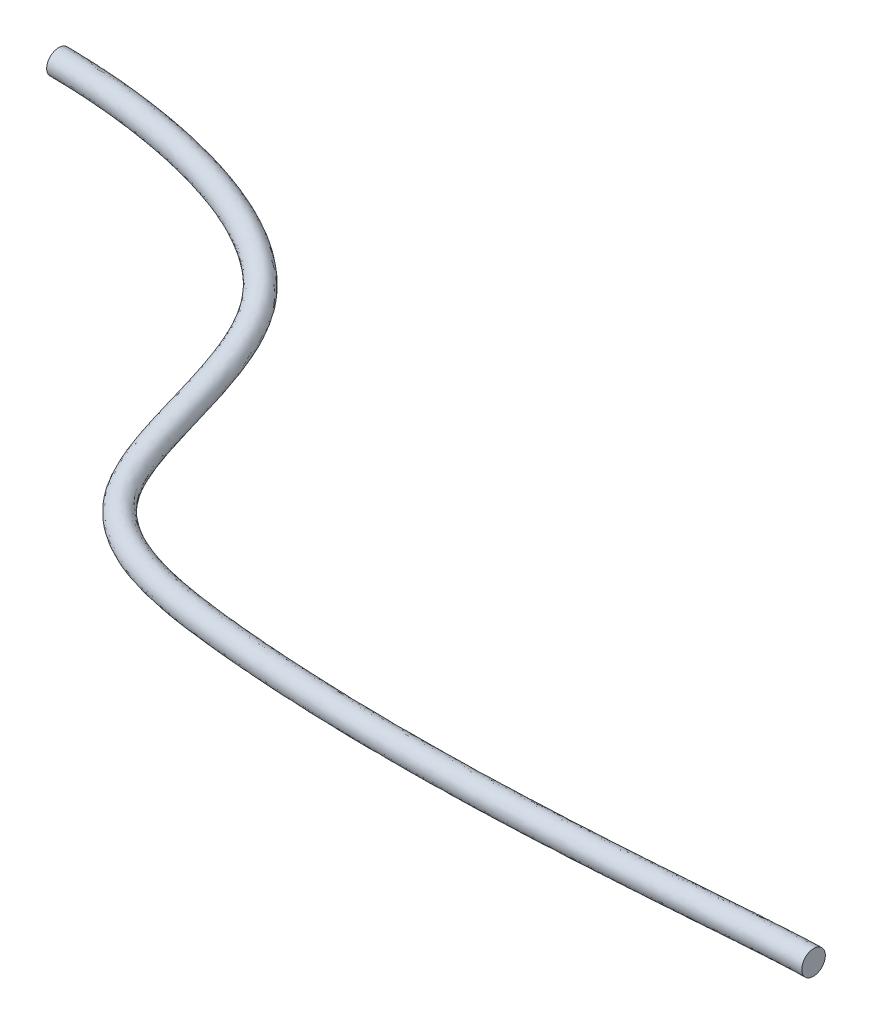
ISO-10303-21;
HEADER;
FILE_DESCRIPTION(('STEP AP214'),'2;1');
FILE_NAME('part.step','',(''),(''),'','','');
FILE_SCHEMA(('AUTOMOTIVE_DESIGN { 1 0 10303 214 1 1 1 1 }'));
ENDSEC;
DATA;
#1=APPLICATION_CONTEXT('core data for automotive mechanical design processes');
#2=APPLICATION_PROTOCOL_DEFINITION('international standard','automotive_design',2000,#1);
#3=PRODUCT_CONTEXT('',#1,'mechanical');
#4=PRODUCT('Part','Part','',(#3));
#5=PRODUCT_RELATED_PRODUCT_CATEGORY('part','',(#4));
#6=PRODUCT_DEFINITION_FORMATION('','',#4);
#7=PRODUCT_DEFINITION_CONTEXT('part definition',#1,'design');
#8=PRODUCT_DEFINITION('design','',#6,#7);
#9=PRODUCT_DEFINITION_SHAPE('','',#8);
#10=(LENGTH_UNIT() NAMED_UNIT(*) SI_UNIT(.MILLI.,.METRE.));
#11=(NAMED_UNIT(*) PLANE_ANGLE_UNIT() SI_UNIT($,.RADIAN.));
#12=(NAMED_UNIT(*) SI_UNIT($,.STERADIAN.) SOLID_ANGLE_UNIT());
#13=UNCERTAINTY_MEASURE_WITH_UNIT(LENGTH_MEASURE(1.E-05),#10,'distance_accuracy_value','');
#14=(GEOMETRIC_REPRESENTATION_CONTEXT(3) GLOBAL_UNCERTAINTY_ASSIGNED_CONTEXT((#13)) GLOBAL_UNIT_ASSIGNED_CONTEXT((#10,
#11,#12)) REPRESENTATION_CONTEXT('',''));
#15=CARTESIAN_POINT('',(0.,0.,0.));
#16=DIRECTION('',(0.,0.,1.));
#17=DIRECTION('',(1.,0.,0.));
#18=AXIS2_PLACEMENT_3D('',#15,#16,#17);
#19=CARTESIAN_POINT('',(0.,40.894,0.));
#20=DIRECTION('',(1.,0.,0.));
#21=DIRECTION('',(0.,0.,-1.));
#22=AXIS2_PLACEMENT_3D('',#19,#20,#21);
#23=PLANE('',#22);
#24=CARTESIAN_POINT('',(0.,40.894,0.));
#25=DIRECTION('',(1.,0.,0.));
#26=DIRECTION('',(0.,0.,-1.));
#27=AXIS2_PLACEMENT_3D('',#24,#25,#26);
#28=CIRCLE('',#27,3.5);
#29=CARTESIAN_POINT('',(0.,40.894,-3.5));
#30=VERTEX_POINT('',#29);
#31=EDGE_CURVE('E37',#30,#30,#28,.T.);
#32=ORIENTED_EDGE('',*,*,#31,.F.);
#33=EDGE_LOOP('',(#32));
#34=FACE_BOUND('',#33,.T.);
#35=ADVANCED_FACE('F31',(#34),#23,.F.);
#36=CARTESIAN_POINT('',(300.,3.5,80.));
#37=DIRECTION('',(0.999845777551215,0.,-0.0175619222469162));
#38=DIRECTION('',(-0.014942242814895,-0.525438065891784,-0.850700633766993));
#39=AXIS2_PLACEMENT_3D('',#36,#37,#38);
#40=PLANE('',#39);
#41=CARTESIAN_POINT('',(300.,3.5,80.));
#42=DIRECTION('',(0.999845777551215,0.,-0.0175619222469162));
#43=DIRECTION('',(-0.014942242814895,-0.525438065891784,-0.850700633766993));
#44=AXIS2_PLACEMENT_3D('',#41,#42,#43);
#45=CIRCLE('',#44,3.5);
#46=CARTESIAN_POINT('',(299.947702150148,1.66096676937876,77.0225477818155));
#47=VERTEX_POINT('',#46);
#48=EDGE_CURVE('E10',#47,#47,#45,.T.);
#49=ORIENTED_EDGE('',*,*,#48,.T.);
#50=EDGE_LOOP('',(#49));
#51=FACE_BOUND('',#50,.T.);
#52=ADVANCED_FACE('F46',(#51),#40,.T.);
#53=CARTESIAN_POINT('',(0.,40.894,-3.5));
#54=CARTESIAN_POINT('',(2.01154749714512,40.894000000136,-3.50000000075374));
#55=CARTESIAN_POINT('',(4.53093904936252,40.799288712623,-3.54494494887828));
#56=CARTESIAN_POINT('',(10.2747043570144,40.4238705636875,-3.62647322945986));
#57=CARTESIAN_POINT('',(13.5020701624385,40.1436824767701,-3.6627617629485));
#58=CARTESIAN_POINT('',(20.4098579727324,39.407124950405,-3.62433390335425));
#59=CARTESIAN_POINT('',(24.0906681546379,38.9508013343628,-3.54965696557129));
#60=CARTESIAN_POINT('',(28.8219222253145,38.275295044426,-3.32222159435461));
#61=CARTESIAN_POINT('',(29.7751227546401,38.1371224194322,-3.27012755166673));
#62=CARTESIAN_POINT('',(31.6814558130594,37.791090449763,-3.15029110921208));
#63=CARTESIAN_POINT('',(32.6362530550064,37.5956265310268,-3.08214068771379));
#64=CARTESIAN_POINT('',(35.5131661929898,37.0283790966926,-2.85163355752494));
#65=CARTESIAN_POINT('',(37.4428380263241,36.6426649308838,-2.66328854362416));
#66=CARTESIAN_POINT('',(43.2216778808381,35.4498338777785,-1.97763809390194));
#67=CARTESIAN_POINT('',(47.0604673874683,34.6063728566016,-1.3602829381917));
#68=CARTESIAN_POINT('',(54.4744401651719,32.7873026956456,0.307423920055103));
#69=CARTESIAN_POINT('',(58.0502010167115,31.8125390939893,1.35750689694464));
#70=CARTESIAN_POINT('',(64.7031554218752,29.709984587472,4.028646009042));
#71=CARTESIAN_POINT('',(67.7828078445753,28.5818679370771,5.65017118889926));
#72=CARTESIAN_POINT('',(73.1697235723105,26.1527563365481,9.63365593762592));
#73=CARTESIAN_POINT('',(75.47721846455,24.8492060456333,12.0021722168609));
#74=CARTESIAN_POINT('',(78.3303546214462,22.5733565600546,16.6192208729553));
#75=CARTESIAN_POINT('',(79.1898146298352,21.6724202402732,18.5784307609023));
#76=CARTESIAN_POINT('',(80.5126585832972,19.8708587382981,22.6632012882764));
#77=CARTESIAN_POINT('',(80.9793329163709,18.9728031166037,24.7901842184797));
#78=CARTESIAN_POINT('',(82.0078234436059,16.3101147515137,31.3155389350218));
#79=CARTESIAN_POINT('',(82.2024881076711,14.5745220832715,35.8631785210636));
#80=CARTESIAN_POINT('',(82.5634985433286,11.3204041642382,44.7964300435393));
#81=CARTESIAN_POINT('',(82.7297384000399,9.80237727922136,49.1832412218148));
#82=CARTESIAN_POINT('',(83.5744101097529,7.82701991019907,55.1439723918627));
#83=CARTESIAN_POINT('',(83.9542814597846,7.21933730684641,57.0261744422094));
#84=CARTESIAN_POINT('',(84.9885477131192,6.12849784638898,60.4947908838428));
#85=CARTESIAN_POINT('',(85.6444173731672,5.64938122337929,62.0789379263091));
#86=CARTESIAN_POINT('',(87.2172934469082,4.84308429909567,64.7943076922755));
#87=CARTESIAN_POINT('',(88.134728127824,4.50245576765487,65.9872700779648));
#88=CARTESIAN_POINT('',(90.2854983700475,3.89636530894898,68.1967839547805));
#89=CARTESIAN_POINT('',(91.5197097714162,3.63114676490895,69.2127793009757));
#90=CARTESIAN_POINT('',(95.6736526158779,2.9336184512699,72.0231695388154));
#91=CARTESIAN_POINT('',(99.0491719329777,2.60184035962877,73.5752228845898));
#92=CARTESIAN_POINT('',(106.686112907786,2.11593625836319,76.1459510958506));
#93=CARTESIAN_POINT('',(110.942594275142,1.96516254396669,77.1619372296821));
#94=CARTESIAN_POINT('',(116.570200828626,1.77979610108075,78.2371382936143));
#95=CARTESIAN_POINT('',(117.710419536232,1.73595638628123,78.4467930170873));
#96=CARTESIAN_POINT('',(120.018322834317,1.67155566137163,78.8361670653727));
#97=CARTESIAN_POINT('',(121.187790871248,1.67109817855068,79.0032213605009));
#98=CARTESIAN_POINT('',(124.72313246581,1.6609713437164,79.4864485283583));
#99=CARTESIAN_POINT('',(127.118147795764,1.66096676870882,79.7740444817306));
#100=CARTESIAN_POINT('',(163.462013746884,1.66096677880895,83.7844444576612));
#101=CARTESIAN_POINT('',(199.689205280887,1.6609667694864,83.156841547052));
#102=CARTESIAN_POINT('',(246.039511057577,1.66096676932494,80.7066778501559));
#103=CARTESIAN_POINT('',(260.159128667697,1.66096676933751,79.6401580449129));
#104=CARTESIAN_POINT('',(277.945375035183,1.66096676939939,78.3024471178486));
#105=CARTESIAN_POINT('',(283.308557251425,1.66096676937876,77.900194097823));
#106=CARTESIAN_POINT('',(292.684981011474,1.66096676937876,77.2891160750823));
#107=CARTESIAN_POINT('',(296.694318877003,1.66096676933479,77.0796922593414));
#108=CARTESIAN_POINT('',(299.947702150148,1.66096676937876,77.0225477818155));
#109=CARTESIAN_POINT('',(0.,47.894,-3.5));
#110=CARTESIAN_POINT('',(2.22894463425912,47.893999999635,-3.50000000096845));
#111=CARTESIAN_POINT('',(4.87579317512623,47.7916835930727,-3.5480724877518));
#112=CARTESIAN_POINT('',(10.8428482829054,47.4016706044173,-3.63274898379947));
#113=CARTESIAN_POINT('',(14.1593894842775,47.1132715928959,-3.66986663387644));
#114=CARTESIAN_POINT('',(21.2369938780311,46.3586068125829,-3.63047650978935));
#115=CARTESIAN_POINT('',(24.9974543867814,45.8923215631077,-3.55409992355655));
#116=CARTESIAN_POINT('',(29.8320058830529,45.2020668195475,-3.32168697714516));
#117=CARTESIAN_POINT('',(30.8055482776334,45.0611198428945,-3.26402184161379));
#118=CARTESIAN_POINT('',(32.7612312432811,44.7068124074991,-3.25241445688137));
#119=CARTESIAN_POINT('',(33.743995760297,44.5051523355007,-3.27306349328299));
#120=CARTESIAN_POINT('',(36.7046054597308,43.9168621310381,-3.2384707417303));
#121=CARTESIAN_POINT('',(38.6936562080486,43.5133834823156,-3.15356337842391));
#122=CARTESIAN_POINT('',(44.6643922702159,42.262323225187,-2.72283597695357));
#123=CARTESIAN_POINT('',(48.6492917742041,41.3739330769989,-2.20388478697194));
#124=CARTESIAN_POINT('',(56.4107875350166,39.4492066769177,-0.644149805499152));
#125=CARTESIAN_POINT('',(60.1886037086119,38.4133192414523,0.397101643094019));
#126=CARTESIAN_POINT('',(67.3188057083907,36.149282216971,3.15728931078259));
#127=CARTESIAN_POINT('',(70.6767065164515,34.9200166302502,4.87772491056843));
#128=CARTESIAN_POINT('',(76.6616257328729,32.2185263983465,9.23804945666321));
#129=CARTESIAN_POINT('',(79.2891606097818,30.7404251126651,11.8928904559994));
#130=CARTESIAN_POINT('',(82.5614537724597,28.1351431811135,17.138932253788));
#131=CARTESIAN_POINT('',(83.5117369683584,27.1307129694643,19.337194899686));
#132=CARTESIAN_POINT('',(84.9586601258208,25.160161765492,23.8051465627127));
#133=CARTESIAN_POINT('',(85.4547598834046,24.1990661172614,26.0831845439079));
#134=CARTESIAN_POINT('',(86.5364912972574,21.3984835981486,32.9465371814101));
#135=CARTESIAN_POINT('',(86.7259027669037,19.635815600685,37.5731941803946));
#136=CARTESIAN_POINT('',(87.0833531237572,16.4132849711631,46.4198848355463));
#137=CARTESIAN_POINT('',(87.2530298545082,14.954672991796,50.6428544749934));
#138=CARTESIAN_POINT('',(88.0237337796912,13.1522820027943,56.0816820530243));
#139=CARTESIAN_POINT('',(88.3641151235806,12.6170156975409,57.7414442165891));
#140=CARTESIAN_POINT('',(89.2313552793142,11.7023384260997,60.6499067866759));
#141=CARTESIAN_POINT('',(89.7524292891656,11.3321503108261,61.8976540201912));
#142=CARTESIAN_POINT('',(90.9168758539077,10.7290049490368,63.8764922173375));
#143=CARTESIAN_POINT('',(91.5945153895521,10.4718218796158,64.7480968290065));
#144=CARTESIAN_POINT('',(93.2476942393417,9.99545542305692,66.4175972211781));
#145=CARTESIAN_POINT('',(94.2257740809397,9.77697331808262,67.2139014379189));
#146=CARTESIAN_POINT('',(97.6655857924287,9.17627900163926,69.489532901779));
#147=CARTESIAN_POINT('',(100.645647522326,8.85532198354657,70.8441216186525));
#148=CARTESIAN_POINT('',(107.697854895568,8.33636481218842,73.0806081113919));
#149=CARTESIAN_POINT('',(111.754349429789,8.14712040718437,73.968344754323));
#150=CARTESIAN_POINT('',(117.219702199905,7.82883971201998,74.7742087883482));
#151=CARTESIAN_POINT('',(118.333895880295,7.74553181526007,74.9111549042384));
#152=CARTESIAN_POINT('',(120.590047068734,7.62163153768257,75.1927915807222));
#153=CARTESIAN_POINT('',(121.728423900546,7.62671433285677,75.3646738789746));
#154=CARTESIAN_POINT('',(125.186505237802,7.61681150919466,75.8373450633832));
#155=CARTESIAN_POINT('',(127.544826602731,7.61678972582236,76.120735561386));
#156=CARTESIAN_POINT('',(163.537908906226,7.61678974883532,80.0924279883753));
#157=CARTESIAN_POINT('',(199.59620745048,7.61678972742954,79.4785557576107));
#158=CARTESIAN_POINT('',(245.794772412872,7.61678972730845,77.0364133635276));
#159=CARTESIAN_POINT('',(259.882304157542,7.61678972732819,75.972523652114));
#160=CARTESIAN_POINT('',(277.670012576342,7.61678972735913,74.6347027635532));
#161=CARTESIAN_POINT('',(283.041902121817,7.61678972734881,74.2317032640781));
#162=CARTESIAN_POINT('',(292.473238910073,7.61678972734881,73.6170464627421));
#163=CARTESIAN_POINT('',(296.523960978982,7.6167897273076,73.4040507439853));
#164=CARTESIAN_POINT('',(299.883108232937,7.61678972734882,73.3450485609895));
#165=CARTESIAN_POINT('',(0.,47.894,3.5));
#166=CARTESIAN_POINT('',(2.33166349724493,47.8939999991197,3.49999999879447));
#167=CARTESIAN_POINT('',(4.99056268751189,47.7889047108355,3.45100335547891));
#168=CARTESIAN_POINT('',(10.9265460002616,47.4009014100225,3.36676789402114));
#169=CARTESIAN_POINT('',(14.1939806581392,47.1162534191733,3.33042583673503));
#170=CARTESIAN_POINT('',(21.1268023694639,46.3770089067742,3.36901056491125));
#171=CARTESIAN_POINT('',(24.7908103900485,45.9223012577761,3.44388507103878));
#172=CARTESIAN_POINT('',(29.4719975300915,45.2539312665881,3.66892574432841));
#173=CARTESIAN_POINT('',(30.4123518206882,45.1133644350131,3.72503667434308));
#174=CARTESIAN_POINT('',(32.3168247143857,44.8792238256514,3.73164231743116));
#175=CARTESIAN_POINT('',(33.2782378386737,44.7725595826868,3.70672970105247));
#176=CARTESIAN_POINT('',(36.1606883522975,44.4014861292925,3.72522757271844));
#177=CARTESIAN_POINT('',(38.0887572523785,44.1186076105787,3.795134616021));
#178=CARTESIAN_POINT('',(43.8477912365456,43.1865425888447,4.17248073517281));
#179=CARTESIAN_POINT('',(47.6536197212485,42.455053547545,4.64580201461266));
#180=CARTESIAN_POINT('',(54.9579832202611,40.8239187731868,6.06985941872465));
#181=CARTESIAN_POINT('',(58.4565829945986,39.9230307802541,7.02160065022312));
#182=CARTESIAN_POINT('',(64.9040355971634,37.9705196397037,9.48303759346813));
#183=CARTESIAN_POINT('',(67.8534856737906,36.9184319853344,10.9932945947889));
#184=CARTESIAN_POINT('',(72.9495819680253,34.6725058279343,14.6752498814371));
#185=CARTESIAN_POINT('',(75.0962814836451,33.4779013655806,16.84878679764));
#186=CARTESIAN_POINT('',(77.7454549109196,31.4018145889659,21.063773900508));
#187=CARTESIAN_POINT('',(78.5337863512849,30.5650040667749,22.8811463023599));
#188=CARTESIAN_POINT('',(79.7727534650107,28.8776433210327,26.7069808496768));
#189=CARTESIAN_POINT('',(80.2162681538892,28.0269793195138,28.7209473808855));
#190=CARTESIAN_POINT('',(81.1987072864038,25.4833672354298,34.9544761767036));
#191=CARTESIAN_POINT('',(81.3911125697833,23.7977903678402,39.3680475549977));
#192=CARTESIAN_POINT('',(81.7440094401262,20.61578028372,48.1033221591737));
#193=CARTESIAN_POINT('',(81.9063506913442,19.1196009865462,52.4255628909242));
#194=CARTESIAN_POINT('',(82.743863246803,17.1609377967587,58.335913412587));
#195=CARTESIAN_POINT('',(83.121291853095,16.55594849999,60.2095407577596));
#196=CARTESIAN_POINT('',(84.156194641934,15.4644369600761,63.6802940758368));
#197=CARTESIAN_POINT('',(84.804934503953,14.979057098644,65.2810015768383));
#198=CARTESIAN_POINT('',(86.4250680144293,14.1678363508784,68.0226290358729));
#199=CARTESIAN_POINT('',(87.3678322202924,13.8262853444663,69.22436267156));
#200=CARTESIAN_POINT('',(89.5709699500076,13.2222560549988,71.4399161906751));
#201=CARTESIAN_POINT('',(90.832132323483,12.9599922884221,72.453256798887));
#202=CARTESIAN_POINT('',(95.065600130659,12.2777920987848,75.2356381957701));
#203=CARTESIAN_POINT('',(98.4916854653653,11.9641412645096,76.7450726974692));
#204=CARTESIAN_POINT('',(106.228251229225,11.5419922952415,79.1378146462428));
#205=CARTESIAN_POINT('',(110.532961134043,11.4355453195173,80.0323384208107));
#206=CARTESIAN_POINT('',(116.238008617481,11.3512787597919,80.743592973499));
#207=CARTESIAN_POINT('',(117.397918206764,11.3351424802405,80.8477553413078));
#208=CARTESIAN_POINT('',(119.734059534894,11.3092819336464,81.0811787608318));
#209=CARTESIAN_POINT('',(120.903143705376,11.3050257882937,81.2629616090212));
#210=CARTESIAN_POINT('',(124.448427076827,11.2948688216854,81.7475546937366));
#211=CARTESIAN_POINT('',(126.853914580386,11.2948561884429,82.0364691947952));
#212=CARTESIAN_POINT('',(163.415001467459,11.2948561906803,86.0708386644082));
#213=CARTESIAN_POINT('',(199.74679706496,11.2948561885106,85.4347338697451));
#214=CARTESIAN_POINT('',(246.191073038668,11.2948561886317,82.979602732528));
#215=CARTESIAN_POINT('',(260.330560813383,11.2948561886326,81.911454160349));
#216=CARTESIAN_POINT('',(278.115901760762,11.2948561885707,80.5738113303788));
#217=CARTESIAN_POINT('',(283.473691693709,11.2948561885913,80.1720205907978));
#218=CARTESIAN_POINT('',(292.816108861466,11.2948561885913,79.5631588375651));
#219=CARTESIAN_POINT('',(296.799818277976,11.2948561886325,79.3559470332079));
#220=CARTESIAN_POINT('',(299.987703932641,11.2948561885913,79.2999529973584));
#221=CARTESIAN_POINT('',(0.,40.894,3.5));
#222=CARTESIAN_POINT('',(2.11426636013093,40.8939999996207,3.49999999900918));
#223=CARTESIAN_POINT('',(4.64570856174818,40.7965098303858,3.45413089435243));
#224=CARTESIAN_POINT('',(10.3584020743706,40.4231013692926,3.37304364836075));
#225=CARTESIAN_POINT('',(13.5366613363031,40.1466643030476,3.33753070766296));
#226=CARTESIAN_POINT('',(20.2996664641622,39.4255270445964,3.37515317134635));
#227=CARTESIAN_POINT('',(23.8840241579018,38.9807810290312,3.44832802902405));
#228=CARTESIAN_POINT('',(28.4619138723539,38.3271594914666,3.66839112711897));
#229=CARTESIAN_POINT('',(29.3819262976932,38.1893670115509,3.71893096429013));
#230=CARTESIAN_POINT('',(31.2370492841656,37.9635018679153,3.83376566510045));
#231=CARTESIAN_POINT('',(32.1704951333848,37.8630337782129,3.89765250662187));
#232=CARTESIAN_POINT('',(34.9692490855532,37.5130030949469,4.11206475692338));
#233=CARTESIAN_POINT('',(36.8379390706541,37.2478890591469,4.28540945082076));
#234=CARTESIAN_POINT('',(42.4050768471679,36.3740532414362,4.91767861822444));
#235=CARTESIAN_POINT('',(46.0647953345127,35.6874933271477,5.48940386339045));
#236=CARTESIAN_POINT('',(53.0216358504164,34.1620147919147,7.02143314428136));
#237=CARTESIAN_POINT('',(56.318180302692,33.3222506327911,7.98200590407374));
#238=CARTESIAN_POINT('',(62.288385310654,31.5312220102047,10.3543942917275));
#239=CARTESIAN_POINT('',(64.9595870019257,30.5802832921669,11.7657408731197));
#240=CARTESIAN_POINT('',(69.4576798074516,28.6067357661303,15.0708563623998));
#241=CARTESIAN_POINT('',(71.2843393384133,27.5866822985516,16.9580685585015));
#242=CARTESIAN_POINT('',(73.5143557599061,25.8400279679053,20.5440625196753));
#243=CARTESIAN_POINT('',(74.2118640127617,25.1067113375838,22.1223821635743));
#244=CARTESIAN_POINT('',(75.326751922487,23.5883402938388,25.5650355752424));
#245=CARTESIAN_POINT('',(75.7408411868477,22.800716318858,27.4279470554533));
#246=CARTESIAN_POINT('',(76.670039432768,20.394998388791,33.3234779303231));
#247=CARTESIAN_POINT('',(76.8676979105507,18.7364968504185,37.6580318956667));
#248=CARTESIAN_POINT('',(77.2241548596975,15.5228994768033,46.4798673671667));
#249=CARTESIAN_POINT('',(77.3830592368606,13.9673052739639,50.9659496377456));
#250=CARTESIAN_POINT('',(78.2945395768722,11.8356757041673,57.3982037514254));
#251=CARTESIAN_POINT('',(78.7114581892989,11.1582701092991,59.4942709833763));
#252=CARTESIAN_POINT('',(79.913387075739,9.89059638036183,63.5251781730073));
#253=CARTESIAN_POINT('',(80.6969225879547,9.29628801119711,65.4622854829628));
#254=CARTESIAN_POINT('',(82.7254856074298,8.28191570093731,68.9404445108047));
#255=CARTESIAN_POINT('',(83.9080449585642,7.85691923250377,70.4635359205244));
#256=CARTESIAN_POINT('',(86.6087740807133,7.12316594089241,73.2191029242713));
#257=CARTESIAN_POINT('',(88.1260680139531,6.81416573524842,74.4521346619374));
#258=CARTESIAN_POINT('',(93.073666954121,6.03513154841541,77.7692748328192));
#259=CARTESIAN_POINT('',(96.8952098760172,5.71065964058812,79.4761739634065));
#260=CARTESIAN_POINT('',(105.216509241444,5.32156374141992,82.2031576307015));
#261=CARTESIAN_POINT('',(109.721205979395,5.2535874563118,83.2259308961861));
#262=CARTESIAN_POINT('',(115.588507246203,5.30223514884963,84.206522478761));
#263=CARTESIAN_POINT('',(116.774441862701,5.32556705126169,84.3833934541608));
#264=CARTESIAN_POINT('',(119.162335300477,5.35920605733542,84.7245542454782));
#265=CARTESIAN_POINT('',(120.362510676078,5.3494096339855,84.9015090905475));
#266=CARTESIAN_POINT('',(123.985054304834,5.33902865621129,85.3966581587116));
#267=CARTESIAN_POINT('',(126.427235773419,5.33903323132511,85.6897781151229));
#268=CARTESIAN_POINT('',(163.339106308117,5.33903322071358,89.7628551339327));
#269=CARTESIAN_POINT('',(199.839794895582,5.3390332305136,89.1130196590787));
#270=CARTESIAN_POINT('',(246.435811683266,5.33903323067506,86.6498672192101));
#271=CARTESIAN_POINT('',(260.607385323538,5.3390332306625,85.5790885531892));
#272=CARTESIAN_POINT('',(278.391264219603,5.33903323060062,84.2415556846537));
#273=CARTESIAN_POINT('',(283.740346823253,5.33903323062124,83.8405114245426));
#274=CARTESIAN_POINT('',(293.027850962933,5.33903323062124,83.2352284499053));
#275=CARTESIAN_POINT('',(296.970176175953,5.33903323066521,83.031588548564));
#276=CARTESIAN_POINT('',(300.052297849852,5.33903323062124,82.9774522181845));
#277=CARTESIAN_POINT('',(0.,33.894,3.5));
#278=CARTESIAN_POINT('',(1.89686922301694,33.8940000001217,3.4999999992239));
#279=CARTESIAN_POINT('',(4.30085443598446,33.8041149499361,3.45725843322596));
#280=CARTESIAN_POINT('',(9.79025814847965,33.4453013285627,3.37931940270037));
#281=CARTESIAN_POINT('',(12.879342014467,33.1770751869218,3.3446355785909));
#282=CARTESIAN_POINT('',(19.4725305588605,32.4740451824185,3.38129577778146));
#283=CARTESIAN_POINT('',(22.9772379257551,32.0392608002863,3.45277098700931));
#284=CARTESIAN_POINT('',(27.4518302146164,31.4003877163451,3.66785650990952));
#285=CARTESIAN_POINT('',(28.3515007746982,31.2653695880886,3.71282525423719));
#286=CARTESIAN_POINT('',(30.1572738539455,31.0477799101792,3.93588901276974));
#287=CARTESIAN_POINT('',(31.0627524280958,30.953507973739,4.08857531219128));
#288=CARTESIAN_POINT('',(33.7778098188089,30.6245200606014,4.49890194112833));
#289=CARTESIAN_POINT('',(35.5871208889296,30.3771705077151,4.77568428562051));
#290=CARTESIAN_POINT('',(40.9623624577902,29.5615638940277,5.66287650127607));
#291=CARTESIAN_POINT('',(44.4759709477769,28.9199331067504,6.33300571216824));
#292=CARTESIAN_POINT('',(51.0852884805716,27.5001108106426,7.97300686983807));
#293=CARTESIAN_POINT('',(54.1797776107855,26.7214704853282,8.94241115792436));
#294=CARTESIAN_POINT('',(59.6727350241447,25.0919243807058,11.225750989987));
#295=CARTESIAN_POINT('',(62.0656883300607,24.2421345989994,12.5381871514505));
#296=CARTESIAN_POINT('',(65.9657776468779,22.5409657043263,15.4664628433625));
#297=CARTESIAN_POINT('',(67.4723971931815,21.6954632315226,17.0673503193631));
#298=CARTESIAN_POINT('',(69.2832566088926,20.2782413468447,20.0243511388426));
#299=CARTESIAN_POINT('',(69.8899416742384,19.6484186083927,21.3636180247887));
#300=CARTESIAN_POINT('',(70.8807503799634,18.2990372666448,24.423090300808));
#301=CARTESIAN_POINT('',(71.2654142198062,17.5744533182023,26.1349467300211));
#302=CARTESIAN_POINT('',(72.1413715791321,15.3066295421522,31.6924796839426));
#303=CARTESIAN_POINT('',(72.3442832513181,13.6752033329968,35.9480162363356));
#304=CARTESIAN_POINT('',(72.7043002792689,10.4300186698866,44.8564125751597));
#305=CARTESIAN_POINT('',(72.859767782377,8.81500956138169,49.5063363845671));
#306=CARTESIAN_POINT('',(73.8452159069415,6.51041361157587,56.4604940902637));
#307=CARTESIAN_POINT('',(74.3016245255029,5.76059171860812,58.779001208993));
#308=CARTESIAN_POINT('',(75.670579509544,4.31675580064754,63.3700622701778));
#309=CARTESIAN_POINT('',(76.5889106719564,3.61351892375025,65.6435693890873));
#310=CARTESIAN_POINT('',(79.0259032004302,2.39599505099621,69.8582599857366));
#311=CARTESIAN_POINT('',(80.4482576968361,1.88755312054127,71.7027091694887));
#312=CARTESIAN_POINT('',(83.6465782114191,1.024075826786,74.9982896578675));
#313=CARTESIAN_POINT('',(85.4200037044231,0.668339182074757,76.4510125249878));
#314=CARTESIAN_POINT('',(91.081733777583,-0.207529001953945,80.3029114698683));
#315=CARTESIAN_POINT('',(95.2987342866691,-0.54282198333334,82.2072752293438));
#316=CARTESIAN_POINT('',(104.204767253662,-0.898864812401663,85.2685006151602));
#317=CARTESIAN_POINT('',(108.909450824748,-0.92837040689372,86.4195233715615));
#318=CARTESIAN_POINT('',(114.939005874924,-0.746808462092639,87.669451984023));
#319=CARTESIAN_POINT('',(116.150965518639,-0.684008377717144,87.9190315670139));
#320=CARTESIAN_POINT('',(118.59061106606,-0.590869818975512,88.3679297301246));
#321=CARTESIAN_POINT('',(119.82187764678,-0.606206520322686,88.5400565720739));
#322=CARTESIAN_POINT('',(123.521681532842,-0.6168115092628,89.0457616236867));
#323=CARTESIAN_POINT('',(126.000556966453,-0.616789725792681,89.3430870354506));
#324=CARTESIAN_POINT('',(163.263211148776,-0.616789749253114,93.4548716034573));
#325=CARTESIAN_POINT('',(199.932792726205,-0.616789727483364,92.7913054484124));
#326=CARTESIAN_POINT('',(246.680550327863,-0.616789727281537,90.3201317058921));
#327=CARTESIAN_POINT('',(260.884209833693,-0.616789727307557,89.2467229460293));
#328=CARTESIAN_POINT('',(278.666626678444,-0.616789727369435,87.9093000389285));
#329=CARTESIAN_POINT('',(284.007001952797,-0.616789727348813,87.5090022582875));
#330=CARTESIAN_POINT('',(293.239593064399,-0.616789727348813,86.9072980622455));
#331=CARTESIAN_POINT('',(297.14053407393,-0.616789727302093,86.7072300639201));
#332=CARTESIAN_POINT('',(300.116891767063,-0.616789727348809,86.6549514390105));
#333=CARTESIAN_POINT('',(0.,33.894,-3.5));
#334=CARTESIAN_POINT('',(1.79415036003113,33.894000000637,-3.50000000053902));
#335=CARTESIAN_POINT('',(4.1860849235988,33.8068938321733,-3.54181741000476));
#336=CARTESIAN_POINT('',(9.70656043112348,33.4460705229576,-3.62019747512025));
#337=CARTESIAN_POINT('',(12.8447508405994,33.1740933606443,-3.65565689202057));
#338=CARTESIAN_POINT('',(19.5827220674336,32.4556430882272,-3.61819129691914));
#339=CARTESIAN_POINT('',(23.1838819224945,32.0092811056179,-3.54521400758603));
#340=CARTESIAN_POINT('',(27.8118385675762,31.3485232693044,-3.32275621156405));
#341=CARTESIAN_POINT('',(28.7446972316468,31.21312499597,-3.27623326171968));
#342=CARTESIAN_POINT('',(30.6016803828376,30.8753684920269,-3.0481677615428));
#343=CARTESIAN_POINT('',(31.5285103497158,30.6861007265528,-2.89121788214459));
#344=CARTESIAN_POINT('',(34.3217269262489,30.139896062347,-2.46479637331958));
#345=CARTESIAN_POINT('',(36.1920198445997,29.771946379452,-2.17301370882441));
#346=CARTESIAN_POINT('',(41.7789634914604,28.63734453037,-1.23244021085031));
#347=CARTESIAN_POINT('',(45.4716430007325,27.8388126362043,-0.516681089411455));
#348=CARTESIAN_POINT('',(52.5380927953271,26.1253987143734,1.25899764560936));
#349=CARTESIAN_POINT('',(55.9117983248111,25.2117589465263,2.31791215079525));
#350=CARTESIAN_POINT('',(62.0875051353598,23.270686957973,4.90000270730142));
#351=CARTESIAN_POINT('',(64.8889091726991,22.2437192439039,6.4226174672301));
#352=CARTESIAN_POINT('',(69.6778214117481,20.0869862747498,10.0292624185886));
#353=CARTESIAN_POINT('',(71.6652763193182,18.9579869786016,12.1114539777224));
#354=CARTESIAN_POINT('',(74.0992554704327,17.0115699389958,16.0995094921226));
#355=CARTESIAN_POINT('',(74.8678922913119,16.2141275110821,17.8196666221186));
#356=CARTESIAN_POINT('',(76.0666570407735,14.5815557111042,21.5212560138402));
#357=CARTESIAN_POINT('',(76.5039059493372,13.746540115946,23.4971838930514));
#358=CARTESIAN_POINT('',(77.4791555899544,11.2217459048788,29.6845406886334));
#359=CARTESIAN_POINT('',(77.6790734484385,9.51322856585802,34.1531628617325));
#360=CARTESIAN_POINT('',(78.0436439628999,6.22752335731326,43.1729752515323));
#361=CARTESIAN_POINT('',(78.2064469455715,4.65008156664674,47.7236279686362));
#362=CARTESIAN_POINT('',(79.1250864398145,2.50175781760386,54.206262730701));
#363=CARTESIAN_POINT('',(79.5444477959885,1.82165891615192,56.3109046678296));
#364=CARTESIAN_POINT('',(80.7457401469242,0.55465726667823,60.3396749810098));
#365=CARTESIAN_POINT('',(81.5364054571689,-0.0333878640675621,62.2602218324269));
#366=CARTESIAN_POINT('',(83.5177110399086,-1.04283635084543,65.7121231672135));
#367=CARTESIAN_POINT('',(84.6749408660958,-1.46691034430609,67.226443326923));
#368=CARTESIAN_POINT('',(87.3233025007532,-2.20272480515896,69.9759706883828));
#369=CARTESIAN_POINT('',(88.8136454618926,-2.51467978826472,71.2116571640325));
#370=CARTESIAN_POINT('',(93.681719439327,-3.30904209909946,74.5568061758517));
#371=CARTESIAN_POINT('',(97.4526963436296,-3.65164126428904,76.3063241505272));
#372=CARTESIAN_POINT('',(105.674370920004,-4.10449229546204,79.2112940803094));
#373=CARTESIAN_POINT('',(110.130839120494,-4.21679531925099,80.3555297050413));
#374=CARTESIAN_POINT('',(115.920699457348,-4.26924750985849,81.7000677988803));
#375=CARTESIAN_POINT('',(117.08694319217,-4.27361904269761,81.9824311299362));
#376=CARTESIAN_POINT('',(119.4465985999,-4.27852021493931,82.4795425500232));
#377=CARTESIAN_POINT('',(120.64715784195,-4.28451797575541,82.6417688420273));
#378=CARTESIAN_POINT('',(124.259759693817,-4.29486882176186,83.1355519933333));
#379=CARTESIAN_POINT('',(126.691468988797,-4.29485618840474,83.4273534020753));
#380=CARTESIAN_POINT('',(163.386118587543,-4.29485619121743,87.476460926947));
#381=CARTESIAN_POINT('',(199.782203111294,-4.29485618845675,86.8351273364932));
#382=CARTESIAN_POINT('',(246.284249702282,-4.29485618865858,84.3769423367841));
#383=CARTESIAN_POINT('',(260.435953177853,-4.29485618865318,83.3077924377118));
#384=CARTESIAN_POINT('',(278.220737494024,-4.29485618856036,81.9701914721441));
#385=CARTESIAN_POINT('',(283.575212381034,-4.2948561885913,81.5686849315679));
#386=CARTESIAN_POINT('',(292.896723112876,-4.2948561885913,80.9611856874225));
#387=CARTESIAN_POINT('',(296.864676775024,-4.29485618863801,80.7553337746975));
#388=CARTESIAN_POINT('',(300.012296067359,-4.2948561885913,80.7000470026416));
#389=CARTESIAN_POINT('',(0.,40.894,-3.5));
#390=CARTESIAN_POINT('',(2.01154749714512,40.894000000136,-3.50000000075374));
#391=CARTESIAN_POINT('',(4.53093904936252,40.799288712623,-3.54494494887828));
#392=CARTESIAN_POINT('',(10.2747043570144,40.4238705636875,-3.62647322945986));
#393=CARTESIAN_POINT('',(13.5020701624385,40.1436824767701,-3.6627617629485));
#394=CARTESIAN_POINT('',(20.4098579727324,39.407124950405,-3.62433390335425));
#395=CARTESIAN_POINT('',(24.0906681546379,38.9508013343628,-3.54965696557129));
#396=CARTESIAN_POINT('',(28.8219222253145,38.275295044426,-3.32222159435461));
#397=CARTESIAN_POINT('',(29.7751227546401,38.1371224194322,-3.27012755166673));
#398=CARTESIAN_POINT('',(31.6814558130594,37.791090449763,-3.15029110921208));
#399=CARTESIAN_POINT('',(32.6362530550064,37.5956265310268,-3.08214068771379));
#400=CARTESIAN_POINT('',(35.5131661929898,37.0283790966926,-2.85163355752494));
#401=CARTESIAN_POINT('',(37.4428380263241,36.6426649308838,-2.66328854362416));
#402=CARTESIAN_POINT('',(43.2216778808381,35.4498338777785,-1.97763809390194));
#403=CARTESIAN_POINT('',(47.0604673874683,34.6063728566016,-1.3602829381917));
#404=CARTESIAN_POINT('',(54.4744401651719,32.7873026956456,0.307423920055103));
#405=CARTESIAN_POINT('',(58.0502010167115,31.8125390939893,1.35750689694464));
#406=CARTESIAN_POINT('',(64.7031554218752,29.709984587472,4.028646009042));
#407=CARTESIAN_POINT('',(67.7828078445753,28.5818679370771,5.65017118889926));
#408=CARTESIAN_POINT('',(73.1697235723105,26.1527563365481,9.63365593762592));
#409=CARTESIAN_POINT('',(75.47721846455,24.8492060456333,12.0021722168609));
#410=CARTESIAN_POINT('',(78.3303546214462,22.5733565600546,16.6192208729553));
#411=CARTESIAN_POINT('',(79.1898146298352,21.6724202402732,18.5784307609023));
#412=CARTESIAN_POINT('',(80.5126585832972,19.8708587382981,22.6632012882764));
#413=CARTESIAN_POINT('',(80.9793329163709,18.9728031166037,24.7901842184797));
#414=CARTESIAN_POINT('',(82.0078234436059,16.3101147515137,31.3155389350218));
#415=CARTESIAN_POINT('',(82.2024881076711,14.5745220832715,35.8631785210636));
#416=CARTESIAN_POINT('',(82.5634985433286,11.3204041642382,44.7964300435393));
#417=CARTESIAN_POINT('',(82.7297384000399,9.80237727922136,49.1832412218148));
#418=CARTESIAN_POINT('',(83.5744101097529,7.82701991019907,55.1439723918627));
#419=CARTESIAN_POINT('',(83.9542814597846,7.21933730684641,57.0261744422094));
#420=CARTESIAN_POINT('',(84.9885477131192,6.12849784638898,60.4947908838428));
#421=CARTESIAN_POINT('',(85.6444173731672,5.64938122337929,62.0789379263091));
#422=CARTESIAN_POINT('',(87.2172934469082,4.84308429909567,64.7943076922755));
#423=CARTESIAN_POINT('',(88.134728127824,4.50245576765487,65.9872700779648));
#424=CARTESIAN_POINT('',(90.2854983700475,3.89636530894898,68.1967839547805));
#425=CARTESIAN_POINT('',(91.5197097714162,3.63114676490895,69.2127793009757));
#426=CARTESIAN_POINT('',(95.6736526158779,2.9336184512699,72.0231695388154));
#427=CARTESIAN_POINT('',(99.0491719329777,2.60184035962877,73.5752228845898));
#428=CARTESIAN_POINT('',(106.686112907786,2.11593625836319,76.1459510958506));
#429=CARTESIAN_POINT('',(110.942594275142,1.96516254396669,77.1619372296821));
#430=CARTESIAN_POINT('',(116.570200828626,1.77979610108075,78.2371382936143));
#431=CARTESIAN_POINT('',(117.710419536232,1.73595638628123,78.4467930170873));
#432=CARTESIAN_POINT('',(120.018322834317,1.67155566137163,78.8361670653727));
#433=CARTESIAN_POINT('',(121.187790871248,1.67109817855068,79.0032213605009));
#434=CARTESIAN_POINT('',(124.72313246581,1.6609713437164,79.4864485283583));
#435=CARTESIAN_POINT('',(127.118147795764,1.66096676870882,79.7740444817306));
#436=CARTESIAN_POINT('',(163.462013746884,1.66096677880895,83.7844444576612));
#437=CARTESIAN_POINT('',(199.689205280887,1.6609667694864,83.156841547052));
#438=CARTESIAN_POINT('',(246.039511057577,1.66096676932494,80.7066778501559));
#439=CARTESIAN_POINT('',(260.159128667697,1.66096676933751,79.6401580449129));
#440=CARTESIAN_POINT('',(277.945375035183,1.66096676939939,78.3024471178486));
#441=CARTESIAN_POINT('',(283.308557251425,1.66096676937876,77.900194097823));
#442=CARTESIAN_POINT('',(292.684981011474,1.66096676937876,77.2891160750823));
#443=CARTESIAN_POINT('',(296.694318877003,1.66096676933479,77.0796922593414));
#444=CARTESIAN_POINT('',(299.947702150148,1.66096676937876,77.0225477818155));
#445=(BOUNDED_SURFACE() B_SPLINE_SURFACE(3,3,((#53,#54,#55,#56,#57,#58,#59,#60,#61,#62,#63,#64,
#65,#66,#67,#68,#69,#70,#71,#72,#73,#74,#75,#76,#77,#78,#79,#80,#81,#82,#83,#84,#85,#86,#87,#88,
#89,#90,#91,#92,#93,#94,#95,#96,#97,#98,#99,#100,#101,#102,#103,#104,#105,#106,#107,#108),(#109,
#110,#111,#112,#113,#114,#115,#116,#117,#118,#119,#120,#121,#122,#123,#124,#125,#126,#127,#128,
#129,#130,#131,#132,#133,#134,#135,#136,#137,#138,#139,#140,#141,#142,#143,#144,#145,#146,#147,
#148,#149,#150,#151,#152,#153,#154,#155,#156,#157,#158,#159,#160,#161,#162,#163,#164),(#165,
#166,#167,#168,#169,#170,#171,#172,#173,#174,#175,#176,#177,#178,#179,#180,#181,#182,#183,#184,
#185,#186,#187,#188,#189,#190,#191,#192,#193,#194,#195,#196,#197,#198,#199,#200,#201,#202,#203,
#204,#205,#206,#207,#208,#209,#210,#211,#212,#213,#214,#215,#216,#217,#218,#219,#220),(#221,
#222,#223,#224,#225,#226,#227,#228,#229,#230,#231,#232,#233,#234,#235,#236,#237,#238,#239,#240,
#241,#242,#243,#244,#245,#246,#247,#248,#249,#250,#251,#252,#253,#254,#255,#256,#257,#258,#259,
#260,#261,#262,#263,#264,#265,#266,#267,#268,#269,#270,#271,#272,#273,#274,#275,#276),(#277,
#278,#279,#280,#281,#282,#283,#284,#285,#286,#287,#288,#289,#290,#291,#292,#293,#294,#295,#296,
#297,#298,#299,#300,#301,#302,#303,#304,#305,#306,#307,#308,#309,#310,#311,#312,#313,#314,#315,
#316,#317,#318,#319,#320,#321,#322,#323,#324,#325,#326,#327,#328,#329,#330,#331,#332),(#333,
#334,#335,#336,#337,#338,#339,#340,#341,#342,#343,#344,#345,#346,#347,#348,#349,#350,#351,#352,
#353,#354,#355,#356,#357,#358,#359,#360,#361,#362,#363,#364,#365,#366,#367,#368,#369,#370,#371,
#372,#373,#374,#375,#376,#377,#378,#379,#380,#381,#382,#383,#384,#385,#386,#387,#388),(#389,
#390,#391,#392,#393,#394,#395,#396,#397,#398,#399,#400,#401,#402,#403,#404,#405,#406,#407,#408,
#409,#410,#411,#412,#413,#414,#415,#416,#417,#418,#419,#420,#421,#422,#423,#424,#425,#426,#427,
#428,#429,#430,#431,#432,#433,#434,#435,#436,#437,#438,#439,#440,#441,#442,#443,#444)),
.UNSPECIFIED.,.T.,.F.,.F.) B_SPLINE_SURFACE_WITH_KNOTS((4,3,4),(4,2,2,2,2,2,2,2,2,2,2,2,2,2,2,2,
2,2,2,2,2,2,2,2,2,2,2,4),(0.,0.5,1.),(0.,0.0285723666622331,0.0571447333244663,
0.0857170999866994,0.0928601916522577,0.100003283317816,0.114289466648933,0.142861833311166,
0.171434199973399,0.200006566635632,0.228578933297865,0.247189539620329,0.265800145942792,
0.303021358587719,0.340242571232646,0.358853177555109,0.377463783877573,0.394683631934527,
0.411903479991481,0.44634317610539,0.480782872219298,0.489392796247776,0.498002720276253,
0.515222568333207,0.757611284166603,0.878805642083302,0.939402821041651,1.),
.UNSPECIFIED.) GEOMETRIC_REPRESENTATION_ITEM() RATIONAL_B_SPLINE_SURFACE(((1.,1.,1.,1.,1.,1.,1.,
1.,1.,1.,1.,1.,1.,1.,1.,1.,1.,1.,1.,1.,1.,1.,1.,1.,1.,1.,1.,1.,1.,1.,1.,1.,1.,1.,1.,1.,1.,1.,1.,
1.,1.,1.,1.,1.,1.,1.,1.,1.,1.,1.,1.,1.,1.,1.,1.,1.),(0.333333333333333,0.333333333333333,
0.333333333333333,0.333333333333333,0.333333333333333,0.333333333333333,0.333333333333333,
0.333333333333333,0.333333333333333,0.333333333333333,0.333333333333333,0.333333333333333,
0.333333333333333,0.333333333333333,0.333333333333333,0.333333333333333,0.333333333333333,
0.333333333333333,0.333333333333333,0.333333333333333,0.333333333333333,0.333333333333333,
0.333333333333333,0.333333333333333,0.333333333333333,0.333333333333333,0.333333333333333,
0.333333333333333,0.333333333333333,0.333333333333333,0.333333333333333,0.333333333333333,
0.333333333333333,0.333333333333333,0.333333333333333,0.333333333333333,0.333333333333333,
0.333333333333333,0.333333333333333,0.333333333333333,0.333333333333333,0.333333333333333,
0.333333333333333,0.333333333333333,0.333333333333333,0.333333333333333,0.333333333333333,
0.333333333333333,0.333333333333333,0.333333333333333,0.333333333333333,0.333333333333333,
0.333333333333333,0.333333333333333,0.333333333333333,0.333333333333333),(0.333333333333333,
0.333333333333333,0.333333333333333,0.333333333333333,0.333333333333333,0.333333333333333,
0.333333333333333,0.333333333333333,0.333333333333333,0.333333333333333,0.333333333333333,
0.333333333333333,0.333333333333333,0.333333333333333,0.333333333333333,0.333333333333333,
0.333333333333333,0.333333333333333,0.333333333333333,0.333333333333333,0.333333333333333,
0.333333333333333,0.333333333333333,0.333333333333333,0.333333333333333,0.333333333333333,
0.333333333333333,0.333333333333333,0.333333333333333,0.333333333333333,0.333333333333333,
0.333333333333333,0.333333333333333,0.333333333333333,0.333333333333333,0.333333333333333,
0.333333333333333,0.333333333333333,0.333333333333333,0.333333333333333,0.333333333333333,
0.333333333333333,0.333333333333333,0.333333333333333,0.333333333333333,0.333333333333333,
0.333333333333333,0.333333333333333,0.333333333333333,0.333333333333333,0.333333333333333,
0.333333333333333,0.333333333333333,0.333333333333333,0.333333333333333,0.333333333333333),(1.,
1.,1.,1.,1.,1.,1.,1.,1.,1.,1.,1.,1.,1.,1.,1.,1.,1.,1.,1.,1.,1.,1.,1.,1.,1.,1.,1.,1.,1.,1.,1.,1.,
1.,1.,1.,1.,1.,1.,1.,1.,1.,1.,1.,1.,1.,1.,1.,1.,1.,1.,1.,1.,1.,1.,1.),(0.333333333333333,
0.333333333333333,0.333333333333333,0.333333333333333,0.333333333333333,0.333333333333333,
0.333333333333333,0.333333333333333,0.333333333333333,0.333333333333333,0.333333333333333,
0.333333333333333,0.333333333333333,0.333333333333333,0.333333333333333,0.333333333333333,
0.333333333333333,0.333333333333333,0.333333333333333,0.333333333333333,0.333333333333333,
0.333333333333333,0.333333333333333,0.333333333333333,0.333333333333333,0.333333333333333,
0.333333333333333,0.333333333333333,0.333333333333333,0.333333333333333,0.333333333333333,
0.333333333333333,0.333333333333333,0.333333333333333,0.333333333333333,0.333333333333333,
0.333333333333333,0.333333333333333,0.333333333333333,0.333333333333333,0.333333333333333,
0.333333333333333,0.333333333333333,0.333333333333333,0.333333333333333,0.333333333333333,
0.333333333333333,0.333333333333333,0.333333333333333,0.333333333333333,0.333333333333333,
0.333333333333333,0.333333333333333,0.333333333333333,0.333333333333333,0.333333333333333),
(0.333333333333333,0.333333333333333,0.333333333333333,0.333333333333333,0.333333333333333,
0.333333333333333,0.333333333333333,0.333333333333333,0.333333333333333,0.333333333333333,
0.333333333333333,0.333333333333333,0.333333333333333,0.333333333333333,0.333333333333333,
0.333333333333333,0.333333333333333,0.333333333333333,0.333333333333333,0.333333333333333,
0.333333333333333,0.333333333333333,0.333333333333333,0.333333333333333,0.333333333333333,
0.333333333333333,0.333333333333333,0.333333333333333,0.333333333333333,0.333333333333333,
0.333333333333333,0.333333333333333,0.333333333333333,0.333333333333333,0.333333333333333,
0.333333333333333,0.333333333333333,0.333333333333333,0.333333333333333,0.333333333333333,
0.333333333333333,0.333333333333333,0.333333333333333,0.333333333333333,0.333333333333333,
0.333333333333333,0.333333333333333,0.333333333333333,0.333333333333333,0.333333333333333,
0.333333333333333,0.333333333333333,0.333333333333333,0.333333333333333,0.333333333333333,
0.333333333333333),(1.,1.,1.,1.,1.,1.,1.,1.,1.,1.,1.,1.,1.,1.,1.,1.,1.,1.,1.,1.,1.,1.,1.,1.,1.,
1.,1.,1.,1.,1.,1.,1.,1.,1.,1.,1.,1.,1.,1.,1.,1.,1.,1.,1.,1.,1.,1.,1.,1.,1.,1.,1.,1.,1.,1.,1.))) REPRESENTATION_ITEM('') SURFACE());
#446=ORIENTED_EDGE('',*,*,#48,.F.);
#447=EDGE_LOOP('',(#446));
#448=FACE_BOUND('',#447,.T.);
#449=ORIENTED_EDGE('',*,*,#31,.T.);
#450=EDGE_LOOP('',(#449));
#451=FACE_BOUND('',#450,.T.);
#452=ADVANCED_FACE('F43',(#448,#451),#445,.T.);
#453=CLOSED_SHELL('',(#35,#52,#452));
#454=MANIFOLD_SOLID_BREP('B2',#453);
#455=ADVANCED_BREP_SHAPE_REPRESENTATION('',(#18,#454),#14);
#456=SHAPE_DEFINITION_REPRESENTATION(#9,#455);
ENDSEC;
END-ISO-10303-21;
